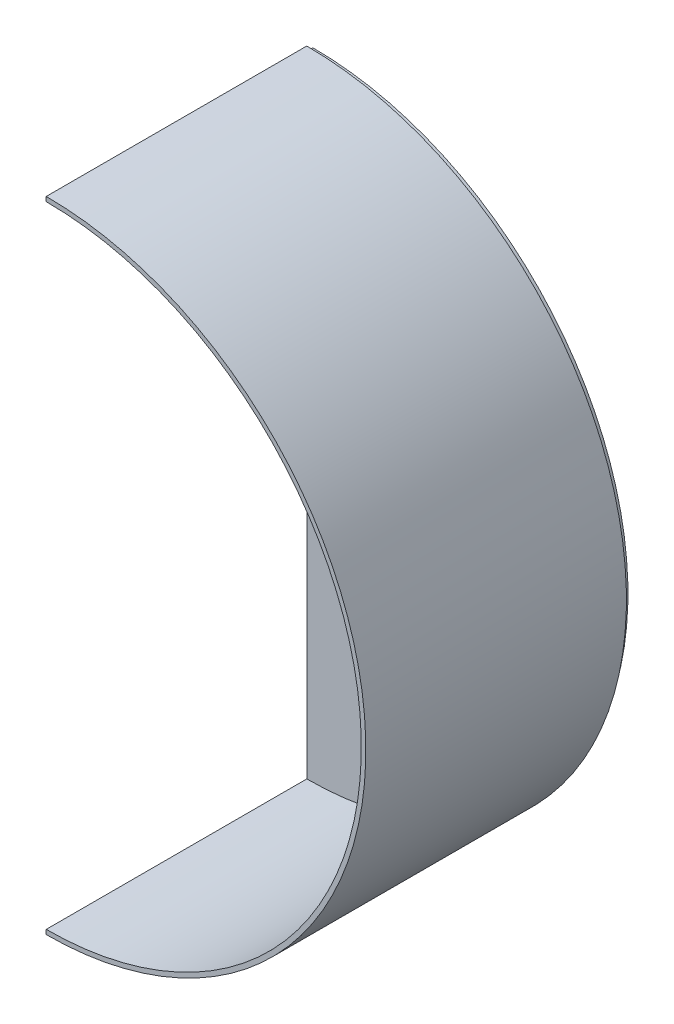
ISO-10303-21;
HEADER;
FILE_DESCRIPTION(('STEP AP214'),'2;1');
FILE_NAME('part.step','',(''),(''),'','','');
FILE_SCHEMA(('AUTOMOTIVE_DESIGN { 1 0 10303 214 1 1 1 1 }'));
ENDSEC;
DATA;
#1=APPLICATION_CONTEXT('core data for automotive mechanical design processes');
#2=APPLICATION_PROTOCOL_DEFINITION('international standard','automotive_design',2000,#1);
#3=PRODUCT_CONTEXT('',#1,'mechanical');
#4=PRODUCT('Part','Part','',(#3));
#5=PRODUCT_RELATED_PRODUCT_CATEGORY('part','',(#4));
#6=PRODUCT_DEFINITION_FORMATION('','',#4);
#7=PRODUCT_DEFINITION_CONTEXT('part definition',#1,'design');
#8=PRODUCT_DEFINITION('design','',#6,#7);
#9=PRODUCT_DEFINITION_SHAPE('','',#8);
#10=(LENGTH_UNIT() NAMED_UNIT(*) SI_UNIT(.MILLI.,.METRE.));
#11=(NAMED_UNIT(*) PLANE_ANGLE_UNIT() SI_UNIT($,.RADIAN.));
#12=(NAMED_UNIT(*) SI_UNIT($,.STERADIAN.) SOLID_ANGLE_UNIT());
#13=UNCERTAINTY_MEASURE_WITH_UNIT(LENGTH_MEASURE(1.E-05),#10,'distance_accuracy_value','');
#14=(GEOMETRIC_REPRESENTATION_CONTEXT(3) GLOBAL_UNCERTAINTY_ASSIGNED_CONTEXT((#13)) GLOBAL_UNIT_ASSIGNED_CONTEXT((#10,
#11,#12)) REPRESENTATION_CONTEXT('',''));
#15=CARTESIAN_POINT('',(0.,0.,0.));
#16=DIRECTION('',(0.,0.,1.));
#17=DIRECTION('',(1.,0.,0.));
#18=AXIS2_PLACEMENT_3D('',#15,#16,#17);
#19=CARTESIAN_POINT('',(0.,105.5,-2.));
#20=DIRECTION('',(0.,0.,1.));
#21=DIRECTION('',(1.,0.,0.));
#22=AXIS2_PLACEMENT_3D('',#19,#20,#21);
#23=CYLINDRICAL_SURFACE('',#22,84.1089437345437);
#24=CARTESIAN_POINT('',(0.,105.5,0.));
#25=DIRECTION('',(0.,0.,-1.));
#26=DIRECTION('',(-1.,0.,0.));
#27=AXIS2_PLACEMENT_3D('',#24,#25,#26);
#28=CIRCLE('',#27,84.1089437345437);
#29=CARTESIAN_POINT('',(32.3478290528326,183.139760250205,0.));
#30=VERTEX_POINT('',#29);
#31=CARTESIAN_POINT('',(76.5012034334526,140.455404294245,0.));
#32=VERTEX_POINT('',#31);
#33=EDGE_CURVE('E218',#30,#32,#28,.T.);
#34=ORIENTED_EDGE('',*,*,#33,.F.);
#35=DIRECTION('',(0.,0.,1.));
#36=VECTOR('',#35,1.);
#37=CARTESIAN_POINT('',(32.3478290528326,183.139760250205,-2.));
#38=LINE('',#37,#36);
#39=CARTESIAN_POINT('',(32.3478290528326,183.139760250205,-2.));
#40=VERTEX_POINT('',#39);
#41=EDGE_CURVE('E12',#40,#30,#38,.T.);
#42=ORIENTED_EDGE('',*,*,#41,.F.);
#43=CARTESIAN_POINT('',(0.,105.5,-2.));
#44=DIRECTION('',(0.,0.,-1.));
#45=DIRECTION('',(-1.,0.,0.));
#46=AXIS2_PLACEMENT_3D('',#43,#44,#45);
#47=CIRCLE('',#46,84.1089437345437);
#48=CARTESIAN_POINT('',(76.5012034334526,140.455404294245,-2.));
#49=VERTEX_POINT('',#48);
#50=EDGE_CURVE('E156',#40,#49,#47,.T.);
#51=ORIENTED_EDGE('',*,*,#50,.T.);
#52=DIRECTION('',(0.,0.,1.));
#53=VECTOR('',#52,1.);
#54=CARTESIAN_POINT('',(76.5012034334526,140.455404294245,-2.));
#55=LINE('',#54,#53);
#56=EDGE_CURVE('E110',#49,#32,#55,.T.);
#57=ORIENTED_EDGE('',*,*,#56,.T.);
#58=EDGE_LOOP('',(#34,#42,#51,#57));
#59=FACE_BOUND('',#58,.T.);
#60=ADVANCED_FACE('F45',(#59),#23,.F.);
#61=CARTESIAN_POINT('',(-0.718710809369774,0.129857889222545,-2.));
#62=DIRECTION('',(-0.984066148584074,0.177802742416722,0.));
#63=DIRECTION('',(-0.177802742416722,-0.984066148584074,0.));
#64=AXIS2_PLACEMENT_3D('',#61,#62,#63);
#65=PLANE('',#64);
#66=DIRECTION('',(-0.177802742416722,-0.984066148584074,0.));
#67=VECTOR('',#66,1.);
#68=CARTESIAN_POINT('',(-0.718710809369774,0.129857889222545,0.));
#69=LINE('',#68,#67);
#70=CARTESIAN_POINT('',(25.900416601859,147.455944282439,0.));
#71=VERTEX_POINT('',#70);
#72=EDGE_CURVE('E161',#30,#71,#69,.T.);
#73=ORIENTED_EDGE('',*,*,#72,.T.);
#74=DIRECTION('',(0.,0.,1.));
#75=VECTOR('',#74,1.);
#76=CARTESIAN_POINT('',(25.900416601859,147.455944282439,-2.));
#77=LINE('',#76,#75);
#78=CARTESIAN_POINT('',(25.900416601859,147.455944282439,-2.));
#79=VERTEX_POINT('',#78);
#80=EDGE_CURVE('E55',#79,#71,#77,.T.);
#81=ORIENTED_EDGE('',*,*,#80,.F.);
#82=DIRECTION('',(-0.177802742416722,-0.984066148584074,0.));
#83=VECTOR('',#82,1.);
#84=CARTESIAN_POINT('',(-0.718710809369774,0.129857889222545,-2.));
#85=LINE('',#84,#83);
#86=EDGE_CURVE('E152',#40,#79,#85,.T.);
#87=ORIENTED_EDGE('',*,*,#86,.F.);
#88=ORIENTED_EDGE('',*,*,#41,.T.);
#89=EDGE_LOOP('',(#73,#81,#87,#88));
#90=FACE_BOUND('',#89,.T.);
#91=ADVANCED_FACE('F159',(#90),#65,.F.);
#92=CARTESIAN_POINT('',(0.,105.5,-2.));
#93=DIRECTION('',(0.,0.,1.));
#94=DIRECTION('',(1.,0.,0.));
#95=AXIS2_PLACEMENT_3D('',#92,#93,#94);
#96=CYLINDRICAL_SURFACE('',#95,49.3065192523356);
#97=CARTESIAN_POINT('',(0.,105.5,0.));
#98=DIRECTION('',(0.,0.,-1.));
#99=DIRECTION('',(-1.,0.,0.));
#100=AXIS2_PLACEMENT_3D('',#97,#98,#99);
#101=CIRCLE('',#100,49.3065192523356);
#102=CARTESIAN_POINT('',(44.698922374936,126.311996043157,0.));
#103=VERTEX_POINT('',#102);
#104=EDGE_CURVE('E221',#71,#103,#101,.T.);
#105=ORIENTED_EDGE('',*,*,#104,.T.);
#106=DIRECTION('',(0.,0.,1.));
#107=VECTOR('',#106,1.);
#108=CARTESIAN_POINT('',(44.698922374936,126.311996043157,-2.));
#109=LINE('',#108,#107);
#110=CARTESIAN_POINT('',(44.698922374936,126.311996043157,-2.));
#111=VERTEX_POINT('',#110);
#112=EDGE_CURVE('E151',#111,#103,#109,.T.);
#113=ORIENTED_EDGE('',*,*,#112,.F.);
#114=CARTESIAN_POINT('',(0.,105.5,-2.));
#115=DIRECTION('',(0.,0.,-1.));
#116=DIRECTION('',(-1.,0.,0.));
#117=AXIS2_PLACEMENT_3D('',#114,#115,#116);
#118=CIRCLE('',#117,49.3065192523356);
#119=EDGE_CURVE('E145',#79,#111,#118,.T.);
#120=ORIENTED_EDGE('',*,*,#119,.F.);
#121=ORIENTED_EDGE('',*,*,#80,.T.);
#122=EDGE_LOOP('',(#105,#113,#120,#121));
#123=FACE_BOUND('',#122,.T.);
#124=ADVANCED_FACE('F148',(#123),#96,.T.);
#125=CARTESIAN_POINT('',(0.,105.5,-2.));
#126=DIRECTION('',(0.,0.,1.));
#127=DIRECTION('',(1.,0.,0.));
#128=AXIS2_PLACEMENT_3D('',#125,#126,#127);
#129=CYLINDRICAL_SURFACE('',#128,25.5);
#130=CARTESIAN_POINT('',(0.,105.5,0.));
#131=DIRECTION('',(0.,0.,-1.));
#132=DIRECTION('',(-1.,0.,0.));
#133=AXIS2_PLACEMENT_3D('',#130,#131,#132);
#134=CIRCLE('',#133,25.5);
#135=CARTESIAN_POINT('',(0.,131.,0.));
#136=VERTEX_POINT('',#135);
#137=CARTESIAN_POINT('',(0.,80.,0.));
#138=VERTEX_POINT('',#137);
#139=EDGE_CURVE('E206',#136,#138,#134,.T.);
#140=ORIENTED_EDGE('',*,*,#139,.F.);
#141=DIRECTION('',(0.,0.,1.));
#142=VECTOR('',#141,1.);
#143=CARTESIAN_POINT('',(0.,131.,-2.));
#144=LINE('',#143,#142);
#145=CARTESIAN_POINT('',(0.,131.,-2.));
#146=VERTEX_POINT('',#145);
#147=EDGE_CURVE('E172',#146,#136,#144,.T.);
#148=ORIENTED_EDGE('',*,*,#147,.F.);
#149=CARTESIAN_POINT('',(0.,105.5,-2.));
#150=DIRECTION('',(0.,0.,-1.));
#151=DIRECTION('',(-1.,0.,0.));
#152=AXIS2_PLACEMENT_3D('',#149,#150,#151);
#153=CIRCLE('',#152,25.5);
#154=CARTESIAN_POINT('',(0.,80.,-2.));
#155=VERTEX_POINT('',#154);
#156=EDGE_CURVE('E232',#146,#155,#153,.T.);
#157=ORIENTED_EDGE('',*,*,#156,.T.);
#158=DIRECTION('',(0.,0.,1.));
#159=VECTOR('',#158,1.);
#160=CARTESIAN_POINT('',(0.,80.,-2.));
#161=LINE('',#160,#159);
#162=EDGE_CURVE('E166',#155,#138,#161,.T.);
#163=ORIENTED_EDGE('',*,*,#162,.T.);
#164=EDGE_LOOP('',(#140,#148,#157,#163));
#165=FACE_BOUND('',#164,.T.);
#166=ADVANCED_FACE('F272',(#165),#129,.F.);
#167=CARTESIAN_POINT('',(0.,0.,-2.));
#168=DIRECTION('',(1.,0.,0.));
#169=DIRECTION('',(0.,1.,0.));
#170=AXIS2_PLACEMENT_3D('',#167,#168,#169);
#171=PLANE('',#170);
#172=DIRECTION('',(0.,1.,0.));
#173=VECTOR('',#172,1.);
#174=CARTESIAN_POINT('',(0.,0.,0.));
#175=LINE('',#174,#173);
#176=CARTESIAN_POINT('',(0.,209.5,0.));
#177=VERTEX_POINT('',#176);
#178=EDGE_CURVE('E209',#136,#177,#175,.T.);
#179=ORIENTED_EDGE('',*,*,#178,.T.);
#180=DIRECTION('',(0.,0.,1.));
#181=VECTOR('',#180,1.);
#182=CARTESIAN_POINT('',(0.,209.5,-2.));
#183=LINE('',#182,#181);
#184=CARTESIAN_POINT('',(0.,209.5,-2.));
#185=VERTEX_POINT('',#184);
#186=EDGE_CURVE('E170',#185,#177,#183,.T.);
#187=ORIENTED_EDGE('',*,*,#186,.F.);
#188=DIRECTION('',(0.,1.,0.));
#189=VECTOR('',#188,1.);
#190=CARTESIAN_POINT('',(0.,0.,-2.));
#191=LINE('',#190,#189);
#192=EDGE_CURVE('E235',#146,#185,#191,.T.);
#193=ORIENTED_EDGE('',*,*,#192,.F.);
#194=ORIENTED_EDGE('',*,*,#147,.T.);
#195=EDGE_LOOP('',(#179,#187,#193,#194));
#196=FACE_BOUND('',#195,.T.);
#197=ADVANCED_FACE('F268',(#196),#171,.F.);
#198=CARTESIAN_POINT('',(0.,105.5,-2.));
#199=DIRECTION('',(0.,0.,1.));
#200=DIRECTION('',(1.,0.,0.));
#201=AXIS2_PLACEMENT_3D('',#198,#199,#200);
#202=CYLINDRICAL_SURFACE('',#201,104.);
#203=CARTESIAN_POINT('',(0.,105.5,0.));
#204=DIRECTION('',(0.,0.,-1.));
#205=DIRECTION('',(-1.,0.,0.));
#206=AXIS2_PLACEMENT_3D('',#203,#204,#205);
#207=CIRCLE('',#206,104.);
#208=CARTESIAN_POINT('',(0.,1.5,0.));
#209=VERTEX_POINT('',#208);
#210=EDGE_CURVE('E212',#209,#177,#207,.F.);
#211=ORIENTED_EDGE('',*,*,#210,.F.);
#212=DIRECTION('',(0.,0.,1.));
#213=VECTOR('',#212,1.);
#214=CARTESIAN_POINT('',(0.,1.5,-2.));
#215=LINE('',#214,#213);
#216=CARTESIAN_POINT('',(0.,1.5,-2.));
#217=VERTEX_POINT('',#216);
#218=EDGE_CURVE('E168',#217,#209,#215,.T.);
#219=ORIENTED_EDGE('',*,*,#218,.F.);
#220=CARTESIAN_POINT('',(0.,105.5,-2.));
#221=DIRECTION('',(0.,0.,-1.));
#222=DIRECTION('',(-1.,0.,0.));
#223=AXIS2_PLACEMENT_3D('',#220,#221,#222);
#224=CIRCLE('',#223,104.);
#225=EDGE_CURVE('E237',#217,#185,#224,.F.);
#226=ORIENTED_EDGE('',*,*,#225,.T.);
#227=ORIENTED_EDGE('',*,*,#186,.T.);
#228=EDGE_LOOP('',(#211,#219,#226,#227));
#229=FACE_BOUND('',#228,.T.);
#230=ADVANCED_FACE('F265',(#229),#202,.T.);
#231=CARTESIAN_POINT('',(0.,105.5,-2.));
#232=DIRECTION('',(0.,0.,1.));
#233=DIRECTION('',(1.,0.,0.));
#234=AXIS2_PLACEMENT_3D('',#231,#232,#233);
#235=CYLINDRICAL_SURFACE('',#234,84.1089437345437);
#236=CARTESIAN_POINT('',(0.,105.5,0.));
#237=DIRECTION('',(0.,0.,-1.));
#238=DIRECTION('',(-1.,0.,0.));
#239=AXIS2_PLACEMENT_3D('',#236,#237,#238);
#240=CIRCLE('',#239,84.1089437345437);
#241=CARTESIAN_POINT('',(77.722279832168,73.3509466106572,0.));
#242=VERTEX_POINT('',#241);
#243=CARTESIAN_POINT('',(29.548996217393,26.7524842380083,0.));
#244=VERTEX_POINT('',#243);
#245=EDGE_CURVE('E191',#242,#244,#240,.T.);
#246=ORIENTED_EDGE('',*,*,#245,.F.);
#247=DIRECTION('',(0.,0.,1.));
#248=VECTOR('',#247,1.);
#249=CARTESIAN_POINT('',(77.722279832168,73.3509466106572,-2.));
#250=LINE('',#249,#248);
#251=CARTESIAN_POINT('',(77.722279832168,73.3509466106572,-2.));
#252=VERTEX_POINT('',#251);
#253=EDGE_CURVE('E49',#252,#242,#250,.T.);
#254=ORIENTED_EDGE('',*,*,#253,.F.);
#255=CARTESIAN_POINT('',(0.,105.5,-2.));
#256=DIRECTION('',(0.,0.,-1.));
#257=DIRECTION('',(-1.,0.,0.));
#258=AXIS2_PLACEMENT_3D('',#255,#256,#257);
#259=CIRCLE('',#258,84.1089437345437);
#260=CARTESIAN_POINT('',(29.548996217393,26.7524842380083,-2.));
#261=VERTEX_POINT('',#260);
#262=EDGE_CURVE('E223',#252,#261,#259,.T.);
#263=ORIENTED_EDGE('',*,*,#262,.T.);
#264=DIRECTION('',(0.,0.,1.));
#265=VECTOR('',#264,1.);
#266=CARTESIAN_POINT('',(29.548996217393,26.7524842380083,-2.));
#267=LINE('',#266,#265);
#268=EDGE_CURVE('E174',#261,#244,#267,.T.);
#269=ORIENTED_EDGE('',*,*,#268,.T.);
#270=EDGE_LOOP('',(#246,#254,#263,#269));
#271=FACE_BOUND('',#270,.T.);
#272=ADVANCED_FACE('F47',(#271),#235,.F.);
#273=CARTESIAN_POINT('',(43.0009184669777,89.949676924875,-2.));
#274=DIRECTION('',(-0.431304539551137,-0.902206403303912,0.));
#275=DIRECTION('',(0.902206403303912,-0.431304539551137,0.));
#276=AXIS2_PLACEMENT_3D('',#273,#274,#275);
#277=PLANE('',#276);
#278=DIRECTION('',(0.902206403303912,-0.431304539551137,0.));
#279=VECTOR('',#278,1.);
#280=CARTESIAN_POINT('',(43.0009184669777,89.949676924875,0.));
#281=LINE('',#280,#279);
#282=CARTESIAN_POINT('',(46.2457596749169,88.3984634353878,0.));
#283=VERTEX_POINT('',#282);
#284=EDGE_CURVE('E187',#283,#242,#281,.T.);
#285=ORIENTED_EDGE('',*,*,#284,.F.);
#286=DIRECTION('',(0.,0.,1.));
#287=VECTOR('',#286,1.);
#288=CARTESIAN_POINT('',(46.2457596749169,88.3984634353878,-2.));
#289=LINE('',#288,#287);
#290=CARTESIAN_POINT('',(46.2457596749169,88.3984634353878,-2.));
#291=VERTEX_POINT('',#290);
#292=EDGE_CURVE('E178',#291,#283,#289,.T.);
#293=ORIENTED_EDGE('',*,*,#292,.F.);
#294=DIRECTION('',(0.902206403303912,-0.431304539551137,0.));
#295=VECTOR('',#294,1.);
#296=CARTESIAN_POINT('',(43.0009184669777,89.949676924875,-2.));
#297=LINE('',#296,#295);
#298=EDGE_CURVE('E189',#291,#252,#297,.T.);
#299=ORIENTED_EDGE('',*,*,#298,.T.);
#300=ORIENTED_EDGE('',*,*,#253,.T.);
#301=EDGE_LOOP('',(#285,#293,#299,#300));
#302=FACE_BOUND('',#301,.T.);
#303=ADVANCED_FACE('F185',(#302),#277,.T.);
#304=CARTESIAN_POINT('',(0.,105.5,-2.));
#305=DIRECTION('',(0.,0.,1.));
#306=DIRECTION('',(1.,0.,0.));
#307=AXIS2_PLACEMENT_3D('',#304,#305,#306);
#308=CYLINDRICAL_SURFACE('',#307,49.3065192523356);
#309=CARTESIAN_POINT('',(0.,105.5,0.));
#310=DIRECTION('',(0.,0.,-1.));
#311=DIRECTION('',(-1.,0.,0.));
#312=AXIS2_PLACEMENT_3D('',#309,#310,#311);
#313=CIRCLE('',#312,49.3065192523356);
#314=CARTESIAN_POINT('',(22.1196555231201,61.4335311112924,0.));
#315=VERTEX_POINT('',#314);
#316=EDGE_CURVE('E199',#283,#315,#313,.T.);
#317=ORIENTED_EDGE('',*,*,#316,.T.);
#318=DIRECTION('',(0.,0.,1.));
#319=VECTOR('',#318,1.);
#320=CARTESIAN_POINT('',(22.1196555231201,61.4335311112924,-2.));
#321=LINE('',#320,#319);
#322=CARTESIAN_POINT('',(22.1196555231201,61.4335311112924,-2.));
#323=VERTEX_POINT('',#322);
#324=EDGE_CURVE('E176',#323,#315,#321,.T.);
#325=ORIENTED_EDGE('',*,*,#324,.F.);
#326=CARTESIAN_POINT('',(0.,105.5,-2.));
#327=DIRECTION('',(0.,0.,-1.));
#328=DIRECTION('',(-1.,0.,0.));
#329=AXIS2_PLACEMENT_3D('',#326,#327,#328);
#330=CIRCLE('',#329,49.3065192523356);
#331=EDGE_CURVE('E226',#291,#323,#330,.T.);
#332=ORIENTED_EDGE('',*,*,#331,.F.);
#333=ORIENTED_EDGE('',*,*,#292,.T.);
#334=EDGE_LOOP('',(#317,#325,#332,#333));
#335=FACE_BOUND('',#334,.T.);
#336=ADVANCED_FACE('F263',(#335),#308,.T.);
#337=CARTESIAN_POINT('',(0.,0.,-2.));
#338=DIRECTION('',(1.,0.,0.));
#339=DIRECTION('',(0.,1.,0.));
#340=AXIS2_PLACEMENT_3D('',#337,#338,#339);
#341=PLANE('',#340);
#342=DIRECTION('',(0.,1.,0.));
#343=VECTOR('',#342,1.);
#344=CARTESIAN_POINT('',(0.,0.,0.));
#345=LINE('',#344,#343);
#346=EDGE_CURVE('E215',#209,#138,#345,.T.);
#347=ORIENTED_EDGE('',*,*,#346,.T.);
#348=ORIENTED_EDGE('',*,*,#162,.F.);
#349=DIRECTION('',(0.,1.,0.));
#350=VECTOR('',#349,1.);
#351=CARTESIAN_POINT('',(0.,0.,-2.));
#352=LINE('',#351,#350);
#353=EDGE_CURVE('E240',#217,#155,#352,.T.);
#354=ORIENTED_EDGE('',*,*,#353,.F.);
#355=ORIENTED_EDGE('',*,*,#218,.T.);
#356=EDGE_LOOP('',(#347,#348,#354,#355));
#357=FACE_BOUND('',#356,.T.);
#358=ADVANCED_FACE('F259',(#357),#341,.F.);
#359=CARTESIAN_POINT('',(33.7319360522961,7.2260230818748,-2.));
#360=DIRECTION('',(-0.977815768416689,-0.20946675878449,0.));
#361=DIRECTION('',(0.20946675878449,-0.977815768416689,0.));
#362=AXIS2_PLACEMENT_3D('',#359,#360,#361);
#363=PLANE('',#362);
#364=DIRECTION('',(0.20946675878449,-0.977815768416689,0.));
#365=VECTOR('',#364,1.);
#366=CARTESIAN_POINT('',(33.7319360522961,7.2260230818748,0.));
#367=LINE('',#366,#365);
#368=EDGE_CURVE('E201',#315,#244,#367,.T.);
#369=ORIENTED_EDGE('',*,*,#368,.T.);
#370=ORIENTED_EDGE('',*,*,#268,.F.);
#371=DIRECTION('',(0.20946675878449,-0.977815768416689,0.));
#372=VECTOR('',#371,1.);
#373=CARTESIAN_POINT('',(33.7319360522961,7.2260230818748,-2.));
#374=LINE('',#373,#372);
#375=EDGE_CURVE('E230',#323,#261,#374,.T.);
#376=ORIENTED_EDGE('',*,*,#375,.F.);
#377=ORIENTED_EDGE('',*,*,#324,.T.);
#378=EDGE_LOOP('',(#369,#370,#376,#377));
#379=FACE_BOUND('',#378,.T.);
#380=ADVANCED_FACE('F262',(#379),#363,.F.);
#381=CARTESIAN_POINT('',(-39.5178968734347,88.8583035219771,-2.));
#382=DIRECTION('',(0.40635584844112,-0.913714903259051,0.));
#383=DIRECTION('',(0.913714903259051,0.40635584844112,0.));
#384=AXIS2_PLACEMENT_3D('',#381,#382,#383);
#385=PLANE('',#384);
#386=DIRECTION('',(0.913714903259051,0.40635584844112,0.));
#387=VECTOR('',#386,1.);
#388=CARTESIAN_POINT('',(-39.5178968734347,88.8583035219771,0.));
#389=LINE('',#388,#387);
#390=EDGE_CURVE('E103',#103,#32,#389,.T.);
#391=ORIENTED_EDGE('',*,*,#390,.T.);
#392=ORIENTED_EDGE('',*,*,#56,.F.);
#393=DIRECTION('',(0.913714903259051,0.40635584844112,0.));
#394=VECTOR('',#393,1.);
#395=CARTESIAN_POINT('',(-39.5178968734347,88.8583035219771,-2.));
#396=LINE('',#395,#394);
#397=EDGE_CURVE('E64',#111,#49,#396,.T.);
#398=ORIENTED_EDGE('',*,*,#397,.F.);
#399=ORIENTED_EDGE('',*,*,#112,.T.);
#400=EDGE_LOOP('',(#391,#392,#398,#399));
#401=FACE_BOUND('',#400,.T.);
#402=ADVANCED_FACE('F247',(#401),#385,.F.);
#403=CARTESIAN_POINT('',(0.,0.,-2.));
#404=DIRECTION('',(0.,0.,-1.));
#405=DIRECTION('',(-1.,0.,0.));
#406=AXIS2_PLACEMENT_3D('',#403,#404,#405);
#407=PLANE('',#406);
#408=ORIENTED_EDGE('',*,*,#262,.F.);
#409=ORIENTED_EDGE('',*,*,#298,.F.);
#410=ORIENTED_EDGE('',*,*,#331,.T.);
#411=ORIENTED_EDGE('',*,*,#375,.T.);
#412=EDGE_LOOP('',(#408,#409,#410,#411));
#413=FACE_BOUND('',#412,.T.);
#414=ORIENTED_EDGE('',*,*,#156,.F.);
#415=ORIENTED_EDGE('',*,*,#192,.T.);
#416=ORIENTED_EDGE('',*,*,#225,.F.);
#417=ORIENTED_EDGE('',*,*,#353,.T.);
#418=EDGE_LOOP('',(#414,#415,#416,#417));
#419=FACE_BOUND('',#418,.T.);
#420=ORIENTED_EDGE('',*,*,#50,.F.);
#421=ORIENTED_EDGE('',*,*,#86,.T.);
#422=ORIENTED_EDGE('',*,*,#119,.T.);
#423=ORIENTED_EDGE('',*,*,#397,.T.);
#424=EDGE_LOOP('',(#420,#421,#422,#423));
#425=FACE_BOUND('',#424,.T.);
#426=ADVANCED_FACE('F155',(#413,#419,#425),#407,.T.);
#427=CARTESIAN_POINT('',(0.,0.,0.));
#428=DIRECTION('',(0.,0.,-1.));
#429=DIRECTION('',(-1.,0.,0.));
#430=AXIS2_PLACEMENT_3D('',#427,#428,#429);
#431=PLANE('',#430);
#432=ORIENTED_EDGE('',*,*,#245,.T.);
#433=ORIENTED_EDGE('',*,*,#368,.F.);
#434=ORIENTED_EDGE('',*,*,#316,.F.);
#435=ORIENTED_EDGE('',*,*,#284,.T.);
#436=EDGE_LOOP('',(#432,#433,#434,#435));
#437=FACE_BOUND('',#436,.T.);
#438=ORIENTED_EDGE('',*,*,#139,.T.);
#439=ORIENTED_EDGE('',*,*,#346,.F.);
#440=ORIENTED_EDGE('',*,*,#210,.T.);
#441=ORIENTED_EDGE('',*,*,#178,.F.);
#442=EDGE_LOOP('',(#438,#439,#440,#441));
#443=FACE_BOUND('',#442,.T.);
#444=ORIENTED_EDGE('',*,*,#33,.T.);
#445=ORIENTED_EDGE('',*,*,#390,.F.);
#446=ORIENTED_EDGE('',*,*,#104,.F.);
#447=ORIENTED_EDGE('',*,*,#72,.F.);
#448=EDGE_LOOP('',(#444,#445,#446,#447));
#449=FACE_BOUND('',#448,.T.);
#450=ADVANCED_FACE('F197',(#437,#443,#449),#431,.F.);
#451=CLOSED_SHELL('',(#60,#91,#124,#166,#197,#230,#272,#303,#336,#358,#380,#402,#426,#450));
#452=MANIFOLD_SOLID_BREP('B2',#451);
#453=CARTESIAN_POINT('',(0.,105.5,86.));
#454=DIRECTION('',(0.,0.,-1.));
#455=DIRECTION('',(-1.,0.,0.));
#456=AXIS2_PLACEMENT_3D('',#453,#454,#455);
#457=CYLINDRICAL_SURFACE('',#456,105.5);
#458=CARTESIAN_POINT('',(0.,105.5,0.));
#459=DIRECTION('',(0.,0.,1.));
#460=DIRECTION('',(-1.,0.,0.));
#461=AXIS2_PLACEMENT_3D('',#458,#459,#460);
#462=CIRCLE('',#461,105.5);
#463=CARTESIAN_POINT('',(0.,0.,0.));
#464=VERTEX_POINT('',#463);
#465=CARTESIAN_POINT('',(0.,211.,0.));
#466=VERTEX_POINT('',#465);
#467=EDGE_CURVE('E444',#464,#466,#462,.T.);
#468=ORIENTED_EDGE('',*,*,#467,.T.);
#469=DIRECTION('',(0.,0.,-1.));
#470=VECTOR('',#469,1.);
#471=CARTESIAN_POINT('',(0.,211.,86.));
#472=LINE('',#471,#470);
#473=CARTESIAN_POINT('',(0.,211.,86.));
#474=VERTEX_POINT('',#473);
#475=EDGE_CURVE('E43',#474,#466,#472,.T.);
#476=ORIENTED_EDGE('',*,*,#475,.F.);
#477=CARTESIAN_POINT('',(0.,105.5,86.));
#478=DIRECTION('',(0.,0.,1.));
#479=DIRECTION('',(-1.,0.,0.));
#480=AXIS2_PLACEMENT_3D('',#477,#478,#479);
#481=CIRCLE('',#480,105.5);
#482=CARTESIAN_POINT('',(0.,0.,86.));
#483=VERTEX_POINT('',#482);
#484=EDGE_CURVE('E432',#483,#474,#481,.T.);
#485=ORIENTED_EDGE('',*,*,#484,.F.);
#486=DIRECTION('',(0.,0.,-1.));
#487=VECTOR('',#486,1.);
#488=CARTESIAN_POINT('',(0.,0.,86.));
#489=LINE('',#488,#487);
#490=EDGE_CURVE('E440',#483,#464,#489,.T.);
#491=ORIENTED_EDGE('',*,*,#490,.T.);
#492=EDGE_LOOP('',(#468,#476,#485,#491));
#493=FACE_BOUND('',#492,.T.);
#494=ADVANCED_FACE('F381',(#493),#457,.T.);
#495=CARTESIAN_POINT('',(0.,209.5,86.));
#496=DIRECTION('',(1.,0.,0.));
#497=DIRECTION('',(0.,1.,0.));
#498=AXIS2_PLACEMENT_3D('',#495,#496,#497);
#499=PLANE('',#498);
#500=DIRECTION('',(0.,-1.,0.));
#501=VECTOR('',#500,1.);
#502=CARTESIAN_POINT('',(0.,209.5,0.));
#503=LINE('',#502,#501);
#504=CARTESIAN_POINT('',(0.,209.5,0.));
#505=VERTEX_POINT('',#504);
#506=EDGE_CURVE('E436',#466,#505,#503,.T.);
#507=ORIENTED_EDGE('',*,*,#506,.T.);
#508=DIRECTION('',(0.,0.,-1.));
#509=VECTOR('',#508,1.);
#510=CARTESIAN_POINT('',(0.,209.5,86.));
#511=LINE('',#510,#509);
#512=CARTESIAN_POINT('',(0.,209.5,86.));
#513=VERTEX_POINT('',#512);
#514=EDGE_CURVE('E389',#513,#505,#511,.T.);
#515=ORIENTED_EDGE('',*,*,#514,.F.);
#516=DIRECTION('',(0.,-1.,0.));
#517=VECTOR('',#516,1.);
#518=CARTESIAN_POINT('',(0.,209.5,86.));
#519=LINE('',#518,#517);
#520=EDGE_CURVE('E427',#474,#513,#519,.T.);
#521=ORIENTED_EDGE('',*,*,#520,.F.);
#522=ORIENTED_EDGE('',*,*,#475,.T.);
#523=EDGE_LOOP('',(#507,#515,#521,#522));
#524=FACE_BOUND('',#523,.T.);
#525=ADVANCED_FACE('F435',(#524),#499,.F.);
#526=CARTESIAN_POINT('',(0.,105.5,86.));
#527=DIRECTION('',(0.,0.,-1.));
#528=DIRECTION('',(-1.,0.,0.));
#529=AXIS2_PLACEMENT_3D('',#526,#527,#528);
#530=CYLINDRICAL_SURFACE('',#529,104.);
#531=CARTESIAN_POINT('',(0.,105.5,0.));
#532=DIRECTION('',(0.,0.,-1.));
#533=DIRECTION('',(-1.,0.,0.));
#534=AXIS2_PLACEMENT_3D('',#531,#532,#533);
#535=CIRCLE('',#534,104.);
#536=CARTESIAN_POINT('',(0.,1.5,0.));
#537=VERTEX_POINT('',#536);
#538=EDGE_CURVE('E414',#505,#537,#535,.T.);
#539=ORIENTED_EDGE('',*,*,#538,.T.);
#540=DIRECTION('',(0.,0.,-1.));
#541=VECTOR('',#540,1.);
#542=CARTESIAN_POINT('',(0.,1.5,86.));
#543=LINE('',#542,#541);
#544=CARTESIAN_POINT('',(0.,1.5,86.));
#545=VERTEX_POINT('',#544);
#546=EDGE_CURVE('E437',#545,#537,#543,.T.);
#547=ORIENTED_EDGE('',*,*,#546,.F.);
#548=CARTESIAN_POINT('',(0.,105.5,86.));
#549=DIRECTION('',(0.,0.,-1.));
#550=DIRECTION('',(-1.,0.,0.));
#551=AXIS2_PLACEMENT_3D('',#548,#549,#550);
#552=CIRCLE('',#551,104.);
#553=EDGE_CURVE('E430',#513,#545,#552,.T.);
#554=ORIENTED_EDGE('',*,*,#553,.F.);
#555=ORIENTED_EDGE('',*,*,#514,.T.);
#556=EDGE_LOOP('',(#539,#547,#554,#555));
#557=FACE_BOUND('',#556,.T.);
#558=ADVANCED_FACE('F438',(#557),#530,.F.);
#559=CARTESIAN_POINT('',(0.,0.,86.));
#560=DIRECTION('',(1.,0.,0.));
#561=DIRECTION('',(0.,0.,-1.));
#562=AXIS2_PLACEMENT_3D('',#559,#560,#561);
#563=PLANE('',#562);
#564=DIRECTION('',(0.,-1.,0.));
#565=VECTOR('',#564,1.);
#566=CARTESIAN_POINT('',(0.,0.,0.));
#567=LINE('',#566,#565);
#568=EDGE_CURVE('E420',#537,#464,#567,.T.);
#569=ORIENTED_EDGE('',*,*,#568,.T.);
#570=ORIENTED_EDGE('',*,*,#490,.F.);
#571=DIRECTION('',(0.,-1.,0.));
#572=VECTOR('',#571,1.);
#573=CARTESIAN_POINT('',(0.,0.,86.));
#574=LINE('',#573,#572);
#575=EDGE_CURVE('E397',#545,#483,#574,.T.);
#576=ORIENTED_EDGE('',*,*,#575,.F.);
#577=ORIENTED_EDGE('',*,*,#546,.T.);
#578=EDGE_LOOP('',(#569,#570,#576,#577));
#579=FACE_BOUND('',#578,.T.);
#580=ADVANCED_FACE('F451',(#579),#563,.F.);
#581=CARTESIAN_POINT('',(0.,105.5,86.));
#582=DIRECTION('',(0.,0.,-1.));
#583=DIRECTION('',(-1.,0.,0.));
#584=AXIS2_PLACEMENT_3D('',#581,#582,#583);
#585=PLANE('',#584);
#586=ORIENTED_EDGE('',*,*,#484,.T.);
#587=ORIENTED_EDGE('',*,*,#520,.T.);
#588=ORIENTED_EDGE('',*,*,#553,.T.);
#589=ORIENTED_EDGE('',*,*,#575,.T.);
#590=EDGE_LOOP('',(#586,#587,#588,#589));
#591=FACE_BOUND('',#590,.T.);
#592=ADVANCED_FACE('F428',(#591),#585,.F.);
#593=CARTESIAN_POINT('',(0.,105.5,0.));
#594=DIRECTION('',(0.,0.,-1.));
#595=DIRECTION('',(-1.,0.,0.));
#596=AXIS2_PLACEMENT_3D('',#593,#594,#595);
#597=PLANE('',#596);
#598=ORIENTED_EDGE('',*,*,#467,.F.);
#599=ORIENTED_EDGE('',*,*,#568,.F.);
#600=ORIENTED_EDGE('',*,*,#538,.F.);
#601=ORIENTED_EDGE('',*,*,#506,.F.);
#602=EDGE_LOOP('',(#598,#599,#600,#601));
#603=FACE_BOUND('',#602,.T.);
#604=ADVANCED_FACE('F454',(#603),#597,.T.);
#605=CLOSED_SHELL('',(#494,#525,#558,#580,#592,#604));
#606=MANIFOLD_SOLID_BREP('B6',#605);
#607=ADVANCED_BREP_SHAPE_REPRESENTATION('',(#18,#452,#606),#14);
#608=SHAPE_DEFINITION_REPRESENTATION(#9,#607);
ENDSEC;
END-ISO-10303-21;
